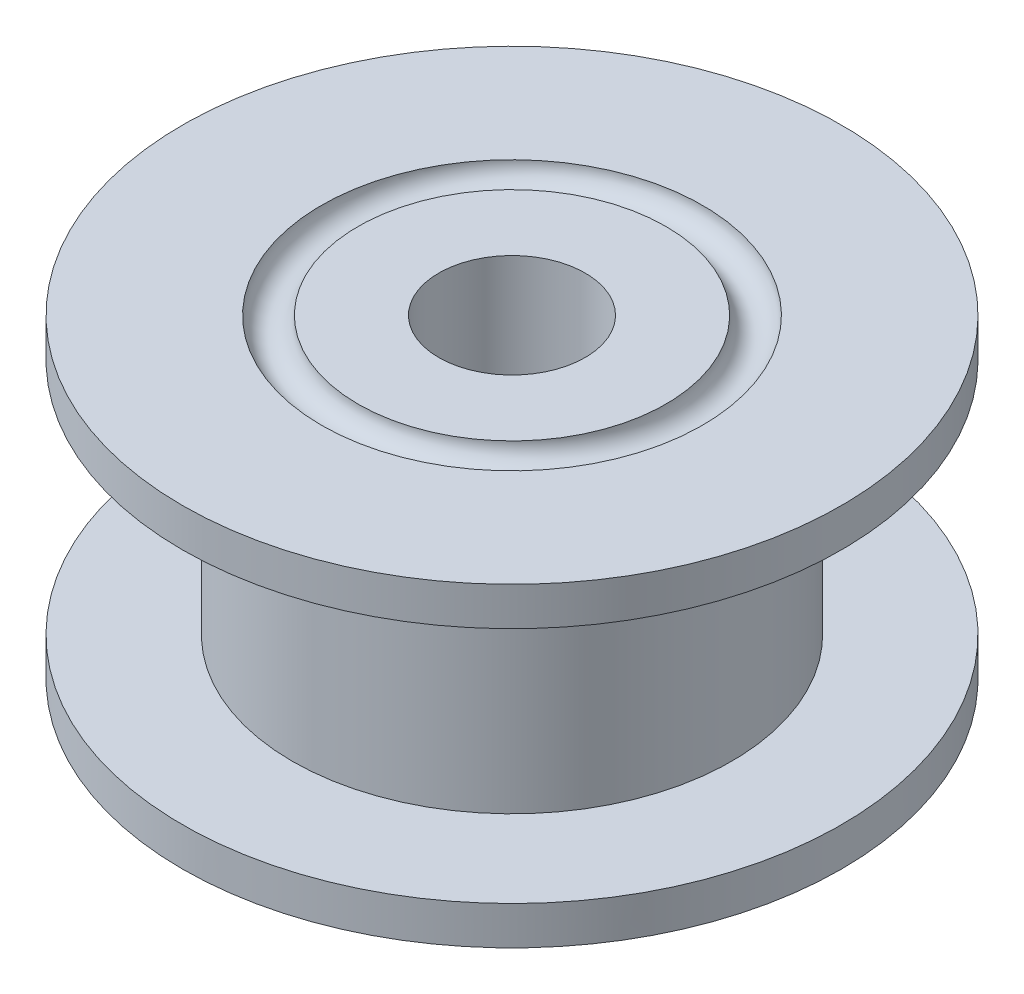
ISO-10303-21;
HEADER;
FILE_DESCRIPTION(('STEP AP214'),'2;1');
FILE_NAME('part.step','',(''),(''),'','','');
FILE_SCHEMA(('AUTOMOTIVE_DESIGN { 1 0 10303 214 1 1 1 1 }'));
ENDSEC;
DATA;
#1=APPLICATION_CONTEXT('core data for automotive mechanical design processes');
#2=APPLICATION_PROTOCOL_DEFINITION('international standard','automotive_design',2000,#1);
#3=PRODUCT_CONTEXT('',#1,'mechanical');
#4=PRODUCT('Part','Part','',(#3));
#5=PRODUCT_RELATED_PRODUCT_CATEGORY('part','',(#4));
#6=PRODUCT_DEFINITION_FORMATION('','',#4);
#7=PRODUCT_DEFINITION_CONTEXT('part definition',#1,'design');
#8=PRODUCT_DEFINITION('design','',#6,#7);
#9=PRODUCT_DEFINITION_SHAPE('','',#8);
#10=(LENGTH_UNIT() NAMED_UNIT(*) SI_UNIT(.MILLI.,.METRE.));
#11=(NAMED_UNIT(*) PLANE_ANGLE_UNIT() SI_UNIT($,.RADIAN.));
#12=(NAMED_UNIT(*) SI_UNIT($,.STERADIAN.) SOLID_ANGLE_UNIT());
#13=UNCERTAINTY_MEASURE_WITH_UNIT(LENGTH_MEASURE(1.E-05),#10,'distance_accuracy_value','');
#14=(GEOMETRIC_REPRESENTATION_CONTEXT(3) GLOBAL_UNCERTAINTY_ASSIGNED_CONTEXT((#13)) GLOBAL_UNIT_ASSIGNED_CONTEXT((#10,
#11,#12)) REPRESENTATION_CONTEXT('',''));
#15=CARTESIAN_POINT('',(0.,0.,0.));
#16=DIRECTION('',(0.,0.,1.));
#17=DIRECTION('',(1.,0.,0.));
#18=AXIS2_PLACEMENT_3D('',#15,#16,#17);
#19=CARTESIAN_POINT('',(0.,0.,0.));
#20=DIRECTION('',(0.,1.,0.));
#21=DIRECTION('',(0.,0.,1.));
#22=AXIS2_PLACEMENT_3D('',#19,#20,#21);
#23=PLANE('',#22);
#24=CARTESIAN_POINT('',(0.,0.,0.));
#25=DIRECTION('',(0.,1.,0.));
#26=DIRECTION('',(0.,0.,1.));
#27=AXIS2_PLACEMENT_3D('',#24,#25,#26);
#28=CIRCLE('',#27,9.);
#29=CARTESIAN_POINT('',(0.,0.,9.));
#30=VERTEX_POINT('',#29);
#31=EDGE_CURVE('E125',#30,#30,#28,.T.);
#32=ORIENTED_EDGE('',*,*,#31,.F.);
#33=EDGE_LOOP('',(#32));
#34=FACE_BOUND('',#33,.T.);
#35=CARTESIAN_POINT('',(0.,0.,0.));
#36=DIRECTION('',(0.,1.,0.));
#37=DIRECTION('',(0.,0.,1.));
#38=AXIS2_PLACEMENT_3D('',#35,#36,#37);
#39=CIRCLE('',#38,5.2);
#40=CARTESIAN_POINT('',(0.,0.,-5.2));
#41=VERTEX_POINT('',#40);
#42=EDGE_CURVE('E12',#41,#41,#39,.T.);
#43=ORIENTED_EDGE('',*,*,#42,.T.);
#44=EDGE_LOOP('',(#43));
#45=FACE_BOUND('',#44,.T.);
#46=ADVANCED_FACE('F67',(#34,#45),#23,.F.);
#47=CARTESIAN_POINT('',(0.,0.,0.));
#48=DIRECTION('',(0.,1.,0.));
#49=DIRECTION('',(0.,0.,1.));
#50=AXIS2_PLACEMENT_3D('',#47,#48,#49);
#51=CIRCLE('',#50,2.);
#52=CARTESIAN_POINT('',(0.,0.,2.));
#53=VERTEX_POINT('',#52);
#54=EDGE_CURVE('E105',#53,#53,#51,.T.);
#55=ORIENTED_EDGE('',*,*,#54,.T.);
#56=EDGE_LOOP('',(#55));
#57=FACE_BOUND('',#56,.T.);
#58=CARTESIAN_POINT('',(0.,0.,0.));
#59=DIRECTION('',(0.,-1.,0.));
#60=DIRECTION('',(0.,0.,-1.));
#61=AXIS2_PLACEMENT_3D('',#58,#59,#60);
#62=CIRCLE('',#61,4.2);
#63=CARTESIAN_POINT('',(0.,0.,-4.2));
#64=VERTEX_POINT('',#63);
#65=EDGE_CURVE('E76',#64,#64,#62,.T.);
#66=ORIENTED_EDGE('',*,*,#65,.T.);
#67=EDGE_LOOP('',(#66));
#68=FACE_BOUND('',#67,.T.);
#69=ADVANCED_FACE('F142',(#57,#68),#23,.F.);
#70=CARTESIAN_POINT('',(0.,8.6,0.));
#71=DIRECTION('',(0.,1.,0.));
#72=DIRECTION('',(0.,0.,1.));
#73=AXIS2_PLACEMENT_3D('',#70,#71,#72);
#74=PLANE('',#73);
#75=CARTESIAN_POINT('',(0.,8.6,0.));
#76=DIRECTION('',(0.,1.,0.));
#77=DIRECTION('',(0.,0.,1.));
#78=AXIS2_PLACEMENT_3D('',#75,#76,#77);
#79=CIRCLE('',#78,9.);
#80=CARTESIAN_POINT('',(0.,8.6,9.));
#81=VERTEX_POINT('',#80);
#82=EDGE_CURVE('E121',#81,#81,#79,.T.);
#83=ORIENTED_EDGE('',*,*,#82,.T.);
#84=EDGE_LOOP('',(#83));
#85=FACE_BOUND('',#84,.T.);
#86=CARTESIAN_POINT('',(0.,8.6,0.));
#87=DIRECTION('',(0.,1.,0.));
#88=DIRECTION('',(0.,0.,1.));
#89=AXIS2_PLACEMENT_3D('',#86,#87,#88);
#90=CIRCLE('',#89,5.20399949747233);
#91=CARTESIAN_POINT('',(0.,8.6,5.20399949747233));
#92=VERTEX_POINT('',#91);
#93=EDGE_CURVE('E98',#92,#92,#90,.T.);
#94=ORIENTED_EDGE('',*,*,#93,.F.);
#95=EDGE_LOOP('',(#94));
#96=FACE_BOUND('',#95,.T.);
#97=ADVANCED_FACE('F156',(#85,#96),#74,.T.);
#98=CARTESIAN_POINT('',(0.,8.6,0.));
#99=DIRECTION('',(0.,1.,0.));
#100=DIRECTION('',(0.,0.,1.));
#101=AXIS2_PLACEMENT_3D('',#98,#99,#100);
#102=CIRCLE('',#101,2.);
#103=CARTESIAN_POINT('',(0.,8.6,2.));
#104=VERTEX_POINT('',#103);
#105=EDGE_CURVE('E100',#104,#104,#102,.T.);
#106=ORIENTED_EDGE('',*,*,#105,.F.);
#107=EDGE_LOOP('',(#106));
#108=FACE_BOUND('',#107,.T.);
#109=CARTESIAN_POINT('',(0.,8.6,0.));
#110=DIRECTION('',(0.,-1.,0.));
#111=DIRECTION('',(0.,0.,-1.));
#112=AXIS2_PLACEMENT_3D('',#109,#110,#111);
#113=CIRCLE('',#112,4.20399949747233);
#114=CARTESIAN_POINT('',(0.,8.6,4.20399949747233));
#115=VERTEX_POINT('',#114);
#116=EDGE_CURVE('E96',#115,#115,#113,.T.);
#117=ORIENTED_EDGE('',*,*,#116,.F.);
#118=EDGE_LOOP('',(#117));
#119=FACE_BOUND('',#118,.T.);
#120=ADVANCED_FACE('F163',(#108,#119),#74,.T.);
#121=CARTESIAN_POINT('',(0.,8.6,0.));
#122=DIRECTION('',(0.,-1.,0.));
#123=DIRECTION('',(0.,0.,-1.));
#124=AXIS2_PLACEMENT_3D('',#121,#122,#123);
#125=CYLINDRICAL_SURFACE('',#124,9.);
#126=CARTESIAN_POINT('',(0.,1.05,0.));
#127=DIRECTION('',(0.,-1.,0.));
#128=DIRECTION('',(0.,0.,-1.));
#129=AXIS2_PLACEMENT_3D('',#126,#127,#128);
#130=CIRCLE('',#129,9.);
#131=CARTESIAN_POINT('',(0.,1.05,-9.));
#132=VERTEX_POINT('',#131);
#133=EDGE_CURVE('E129',#132,#132,#130,.T.);
#134=ORIENTED_EDGE('',*,*,#133,.T.);
#135=EDGE_LOOP('',(#134));
#136=FACE_BOUND('',#135,.T.);
#137=ORIENTED_EDGE('',*,*,#31,.T.);
#138=EDGE_LOOP('',(#137));
#139=FACE_BOUND('',#138,.T.);
#140=ADVANCED_FACE('F169',(#136,#139),#125,.T.);
#141=CARTESIAN_POINT('',(-15.6990948273,1.05,0.));
#142=DIRECTION('',(0.,-1.,0.));
#143=DIRECTION('',(0.,0.,-1.));
#144=AXIS2_PLACEMENT_3D('',#141,#142,#143);
#145=PLANE('',#144);
#146=CARTESIAN_POINT('',(0.,1.05,0.));
#147=DIRECTION('',(0.,1.,0.));
#148=DIRECTION('',(0.,0.,1.));
#149=AXIS2_PLACEMENT_3D('',#146,#147,#148);
#150=CIRCLE('',#149,6.);
#151=CARTESIAN_POINT('',(0.,1.05,6.));
#152=VERTEX_POINT('',#151);
#153=EDGE_CURVE('E116',#152,#152,#150,.T.);
#154=ORIENTED_EDGE('',*,*,#153,.F.);
#155=EDGE_LOOP('',(#154));
#156=FACE_BOUND('',#155,.T.);
#157=ORIENTED_EDGE('',*,*,#133,.F.);
#158=EDGE_LOOP('',(#157));
#159=FACE_BOUND('',#158,.T.);
#160=ADVANCED_FACE('F165',(#156,#159),#145,.F.);
#161=CARTESIAN_POINT('',(-15.6990948273,7.55,0.));
#162=DIRECTION('',(0.,1.,0.));
#163=DIRECTION('',(0.,0.,1.));
#164=AXIS2_PLACEMENT_3D('',#161,#162,#163);
#165=PLANE('',#164);
#166=CARTESIAN_POINT('',(0.,7.55,0.));
#167=DIRECTION('',(0.,1.,0.));
#168=DIRECTION('',(0.,0.,1.));
#169=AXIS2_PLACEMENT_3D('',#166,#167,#168);
#170=CIRCLE('',#169,6.);
#171=CARTESIAN_POINT('',(0.,7.55,6.));
#172=VERTEX_POINT('',#171);
#173=EDGE_CURVE('E111',#172,#172,#170,.T.);
#174=ORIENTED_EDGE('',*,*,#173,.T.);
#175=EDGE_LOOP('',(#174));
#176=FACE_BOUND('',#175,.T.);
#177=CARTESIAN_POINT('',(0.,7.55,0.));
#178=DIRECTION('',(0.,1.,0.));
#179=DIRECTION('',(0.,0.,1.));
#180=AXIS2_PLACEMENT_3D('',#177,#178,#179);
#181=CIRCLE('',#180,9.);
#182=CARTESIAN_POINT('',(0.,7.55,9.));
#183=VERTEX_POINT('',#182);
#184=EDGE_CURVE('E120',#183,#183,#181,.T.);
#185=ORIENTED_EDGE('',*,*,#184,.F.);
#186=EDGE_LOOP('',(#185));
#187=FACE_BOUND('',#186,.T.);
#188=ADVANCED_FACE('F168',(#176,#187),#165,.F.);
#189=CARTESIAN_POINT('',(0.,8.6,0.));
#190=DIRECTION('',(0.,1.,0.));
#191=DIRECTION('',(0.,0.,1.));
#192=AXIS2_PLACEMENT_3D('',#189,#190,#191);
#193=CYLINDRICAL_SURFACE('',#192,6.);
#194=ORIENTED_EDGE('',*,*,#173,.F.);
#195=EDGE_LOOP('',(#194));
#196=FACE_BOUND('',#195,.T.);
#197=ORIENTED_EDGE('',*,*,#153,.T.);
#198=EDGE_LOOP('',(#197));
#199=FACE_BOUND('',#198,.T.);
#200=ADVANCED_FACE('F171',(#196,#199),#193,.T.);
#201=ORIENTED_EDGE('',*,*,#184,.T.);
#202=EDGE_LOOP('',(#201));
#203=FACE_BOUND('',#202,.T.);
#204=ORIENTED_EDGE('',*,*,#82,.F.);
#205=EDGE_LOOP('',(#204));
#206=FACE_BOUND('',#205,.T.);
#207=ADVANCED_FACE('F69',(#203,#206),#125,.T.);
#208=CARTESIAN_POINT('',(0.,0.,0.));
#209=DIRECTION('',(0.,1.,0.));
#210=DIRECTION('',(0.,0.,1.));
#211=AXIS2_PLACEMENT_3D('',#208,#209,#210);
#212=CYLINDRICAL_SURFACE('',#211,2.);
#213=ORIENTED_EDGE('',*,*,#54,.F.);
#214=EDGE_LOOP('',(#213));
#215=FACE_BOUND('',#214,.T.);
#216=ORIENTED_EDGE('',*,*,#105,.T.);
#217=EDGE_LOOP('',(#216));
#218=FACE_BOUND('',#217,.T.);
#219=ADVANCED_FACE('F149',(#215,#218),#212,.F.);
#220=CARTESIAN_POINT('',(0.,8.6,0.));
#221=DIRECTION('',(0.,1.,0.));
#222=DIRECTION('',(0.,0.,1.));
#223=AXIS2_PLACEMENT_3D('',#220,#221,#222);
#224=TOROIDAL_SURFACE('',#223,4.70399949747233,0.5);
#225=ORIENTED_EDGE('',*,*,#93,.T.);
#226=CARTESIAN_POINT('',(0.,8.6,4.70399949747233));
#227=DIRECTION('',(1.,0.,0.));
#228=DIRECTION('',(0.,1.,0.));
#229=AXIS2_PLACEMENT_3D('',#226,#227,#228);
#230=CIRCLE('',#229,0.5);
#231=EDGE_CURVE('E93',#92,#115,#230,.T.);
#232=ORIENTED_EDGE('',*,*,#231,.T.);
#233=ORIENTED_EDGE('',*,*,#116,.T.);
#234=ORIENTED_EDGE('',*,*,#231,.F.);
#235=EDGE_LOOP('',(#225,#232,#233,#234));
#236=FACE_BOUND('',#235,.T.);
#237=ADVANCED_FACE('F94',(#236),#224,.F.);
#238=CARTESIAN_POINT('',(0.,0.,0.));
#239=DIRECTION('',(0.,-1.,0.));
#240=DIRECTION('',(0.,0.,-1.));
#241=AXIS2_PLACEMENT_3D('',#238,#239,#240);
#242=TOROIDAL_SURFACE('',#241,4.7,0.5);
#243=CARTESIAN_POINT('',(0.,0.,-4.7));
#244=DIRECTION('',(1.,0.,0.));
#245=DIRECTION('',(0.,0.,-1.));
#246=AXIS2_PLACEMENT_3D('',#243,#244,#245);
#247=CIRCLE('',#246,0.5);
#248=EDGE_CURVE('E83',#41,#64,#247,.T.);
#249=ORIENTED_EDGE('',*,*,#248,.T.);
#250=ORIENTED_EDGE('',*,*,#65,.F.);
#251=ORIENTED_EDGE('',*,*,#248,.F.);
#252=ORIENTED_EDGE('',*,*,#42,.F.);
#253=EDGE_LOOP('',(#249,#250,#251,#252));
#254=FACE_BOUND('',#253,.T.);
#255=ADVANCED_FACE('F143',(#254),#242,.F.);
#256=CLOSED_SHELL('',(#46,#69,#97,#120,#140,#160,#188,#200,#207,#219,#237,#255));
#257=MANIFOLD_SOLID_BREP('B2',#256);
#258=ADVANCED_BREP_SHAPE_REPRESENTATION('',(#18,#257),#14);
#259=SHAPE_DEFINITION_REPRESENTATION(#9,#258);
ENDSEC;
END-ISO-10303-21;
